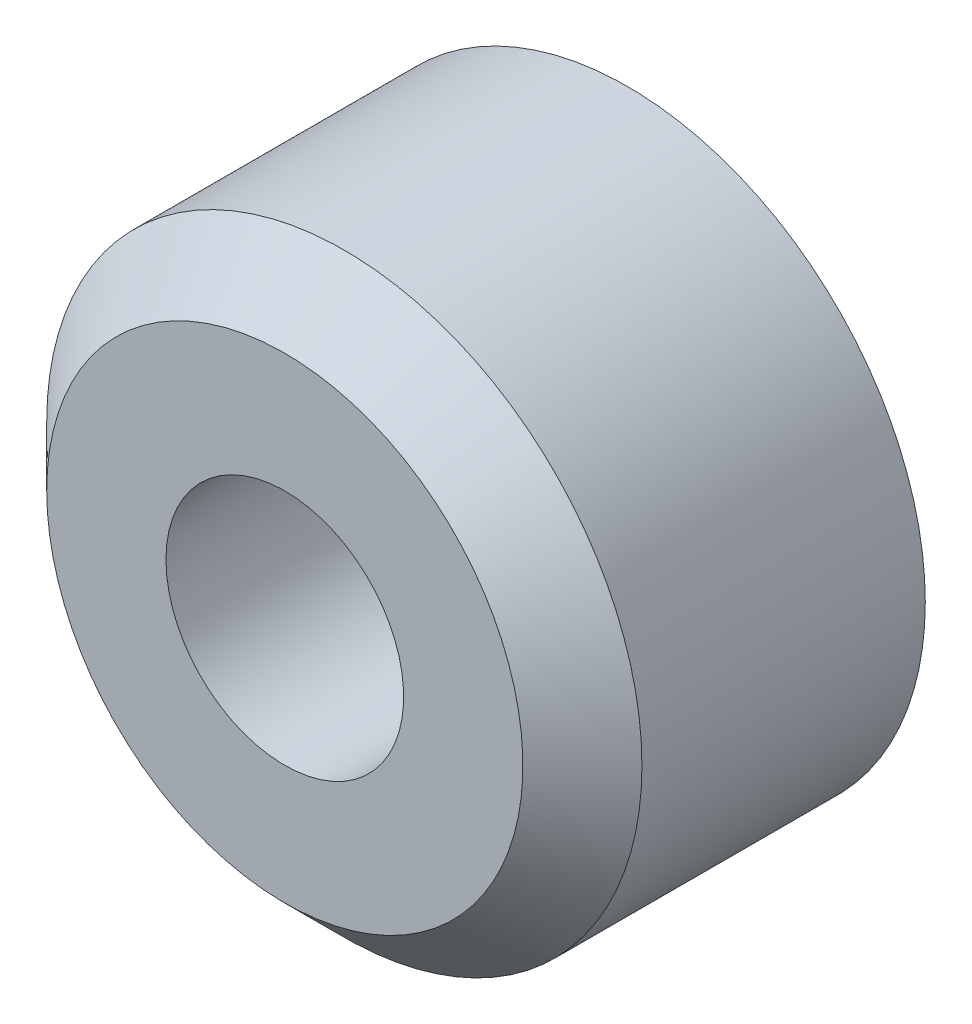
ISO-10303-21;
HEADER;
FILE_DESCRIPTION(('STEP AP214'),'2;1');
FILE_NAME('part.step','',(''),(''),'','','');
FILE_SCHEMA(('AUTOMOTIVE_DESIGN { 1 0 10303 214 1 1 1 1 }'));
ENDSEC;
DATA;
#1=APPLICATION_CONTEXT('core data for automotive mechanical design processes');
#2=APPLICATION_PROTOCOL_DEFINITION('international standard','automotive_design',2000,#1);
#3=PRODUCT_CONTEXT('',#1,'mechanical');
#4=PRODUCT('Part','Part','',(#3));
#5=PRODUCT_RELATED_PRODUCT_CATEGORY('part','',(#4));
#6=PRODUCT_DEFINITION_FORMATION('','',#4);
#7=PRODUCT_DEFINITION_CONTEXT('part definition',#1,'design');
#8=PRODUCT_DEFINITION('design','',#6,#7);
#9=PRODUCT_DEFINITION_SHAPE('','',#8);
#10=(LENGTH_UNIT() NAMED_UNIT(*) SI_UNIT(.MILLI.,.METRE.));
#11=(NAMED_UNIT(*) PLANE_ANGLE_UNIT() SI_UNIT($,.RADIAN.));
#12=(NAMED_UNIT(*) SI_UNIT($,.STERADIAN.) SOLID_ANGLE_UNIT());
#13=UNCERTAINTY_MEASURE_WITH_UNIT(LENGTH_MEASURE(1.E-05),#10,'distance_accuracy_value','');
#14=(GEOMETRIC_REPRESENTATION_CONTEXT(3) GLOBAL_UNCERTAINTY_ASSIGNED_CONTEXT((#13)) GLOBAL_UNIT_ASSIGNED_CONTEXT((#10,
#11,#12)) REPRESENTATION_CONTEXT('',''));
#15=CARTESIAN_POINT('',(0.,0.,0.));
#16=DIRECTION('',(0.,0.,1.));
#17=DIRECTION('',(1.,0.,0.));
#18=AXIS2_PLACEMENT_3D('',#15,#16,#17);
#19=CARTESIAN_POINT('',(0.,0.,4.572));
#20=DIRECTION('',(0.,0.,-1.));
#21=DIRECTION('',(-1.,0.,0.));
#22=AXIS2_PLACEMENT_3D('',#19,#20,#21);
#23=CYLINDRICAL_SURFACE('',#22,3.96874999999742);
#24=CARTESIAN_POINT('',(0.,0.,3.7782500000014));
#25=DIRECTION('',(0.,0.,-1.));
#26=DIRECTION('',(-1.,0.,0.));
#27=AXIS2_PLACEMENT_3D('',#24,#25,#26);
#28=CIRCLE('',#27,3.96874999999742);
#29=CARTESIAN_POINT('',(-3.9687499999974,0.,3.7782500000014));
#30=VERTEX_POINT('',#29);
#31=EDGE_CURVE('E10',#30,#30,#28,.T.);
#32=ORIENTED_EDGE('',*,*,#31,.T.);
#33=EDGE_LOOP('',(#32));
#34=FACE_BOUND('',#33,.T.);
#35=CARTESIAN_POINT('',(0.,0.,0.));
#36=DIRECTION('',(0.,0.,-1.));
#37=DIRECTION('',(-1.,0.,0.));
#38=AXIS2_PLACEMENT_3D('',#35,#36,#37);
#39=CIRCLE('',#38,3.96874999999742);
#40=CARTESIAN_POINT('',(-3.96874999999742,0.,0.));
#41=VERTEX_POINT('',#40);
#42=EDGE_CURVE('E49',#41,#41,#39,.T.);
#43=ORIENTED_EDGE('',*,*,#42,.F.);
#44=EDGE_LOOP('',(#43));
#45=FACE_BOUND('',#44,.T.);
#46=ADVANCED_FACE('F30',(#34,#45),#23,.T.);
#47=CARTESIAN_POINT('',(0.,0.,3.7782500000014));
#48=DIRECTION('',(0.,0.,-1.));
#49=DIRECTION('',(-1.,0.,0.));
#50=AXIS2_PLACEMENT_3D('',#47,#48,#49);
#51=CONICAL_SURFACE('',#50,3.96874999999742,0.785398163397448);
#52=CARTESIAN_POINT('',(0.,0.,4.572));
#53=DIRECTION('',(0.,0.,-1.));
#54=DIRECTION('',(-1.,0.,0.));
#55=AXIS2_PLACEMENT_3D('',#52,#53,#54);
#56=CIRCLE('',#55,3.17499999999882);
#57=CARTESIAN_POINT('',(-3.1749999999988,0.,4.572));
#58=VERTEX_POINT('',#57);
#59=EDGE_CURVE('E36',#58,#58,#56,.T.);
#60=ORIENTED_EDGE('',*,*,#59,.T.);
#61=EDGE_LOOP('',(#60));
#62=FACE_BOUND('',#61,.T.);
#63=ORIENTED_EDGE('',*,*,#31,.F.);
#64=EDGE_LOOP('',(#63));
#65=FACE_BOUND('',#64,.T.);
#66=ADVANCED_FACE('F57',(#62,#65),#51,.T.);
#67=CARTESIAN_POINT('',(3.17499999999885,0.,4.572));
#68=DIRECTION('',(0.,0.,1.));
#69=DIRECTION('',(1.,0.,0.));
#70=AXIS2_PLACEMENT_3D('',#67,#68,#69);
#71=PLANE('',#70);
#72=CARTESIAN_POINT('',(0.,0.,4.572));
#73=DIRECTION('',(0.,0.,-1.));
#74=DIRECTION('',(-1.,0.,0.));
#75=AXIS2_PLACEMENT_3D('',#72,#73,#74);
#76=CIRCLE('',#75,1.58496);
#77=CARTESIAN_POINT('',(-1.58495999999999,0.,4.572));
#78=VERTEX_POINT('',#77);
#79=EDGE_CURVE('E40',#78,#78,#76,.T.);
#80=ORIENTED_EDGE('',*,*,#79,.T.);
#81=EDGE_LOOP('',(#80));
#82=FACE_BOUND('',#81,.T.);
#83=ORIENTED_EDGE('',*,*,#59,.F.);
#84=EDGE_LOOP('',(#83));
#85=FACE_BOUND('',#84,.T.);
#86=ADVANCED_FACE('F61',(#82,#85),#71,.T.);
#87=CARTESIAN_POINT('',(0.,0.,4.572));
#88=DIRECTION('',(0.,0.,-1.));
#89=DIRECTION('',(-1.,0.,0.));
#90=AXIS2_PLACEMENT_3D('',#87,#88,#89);
#91=CYLINDRICAL_SURFACE('',#90,1.58496);
#92=CARTESIAN_POINT('',(0.,0.,0.));
#93=DIRECTION('',(0.,0.,-1.));
#94=DIRECTION('',(-1.,0.,0.));
#95=AXIS2_PLACEMENT_3D('',#92,#93,#94);
#96=CIRCLE('',#95,1.58496);
#97=CARTESIAN_POINT('',(-1.58496,0.,0.));
#98=VERTEX_POINT('',#97);
#99=EDGE_CURVE('E44',#98,#98,#96,.T.);
#100=ORIENTED_EDGE('',*,*,#99,.T.);
#101=EDGE_LOOP('',(#100));
#102=FACE_BOUND('',#101,.T.);
#103=ORIENTED_EDGE('',*,*,#79,.F.);
#104=EDGE_LOOP('',(#103));
#105=FACE_BOUND('',#104,.T.);
#106=ADVANCED_FACE('F65',(#102,#105),#91,.F.);
#107=CARTESIAN_POINT('',(1.58496000000001,0.,0.));
#108=DIRECTION('',(0.,0.,-1.));
#109=DIRECTION('',(-1.,0.,0.));
#110=AXIS2_PLACEMENT_3D('',#107,#108,#109);
#111=PLANE('',#110);
#112=ORIENTED_EDGE('',*,*,#42,.T.);
#113=EDGE_LOOP('',(#112));
#114=FACE_BOUND('',#113,.T.);
#115=ORIENTED_EDGE('',*,*,#99,.F.);
#116=EDGE_LOOP('',(#115));
#117=FACE_BOUND('',#116,.T.);
#118=ADVANCED_FACE('F53',(#114,#117),#111,.T.);
#119=CLOSED_SHELL('',(#46,#66,#86,#106,#118));
#120=MANIFOLD_SOLID_BREP('B2',#119);
#121=ADVANCED_BREP_SHAPE_REPRESENTATION('',(#18,#120),#14);
#122=SHAPE_DEFINITION_REPRESENTATION(#9,#121);
ENDSEC;
END-ISO-10303-21;
